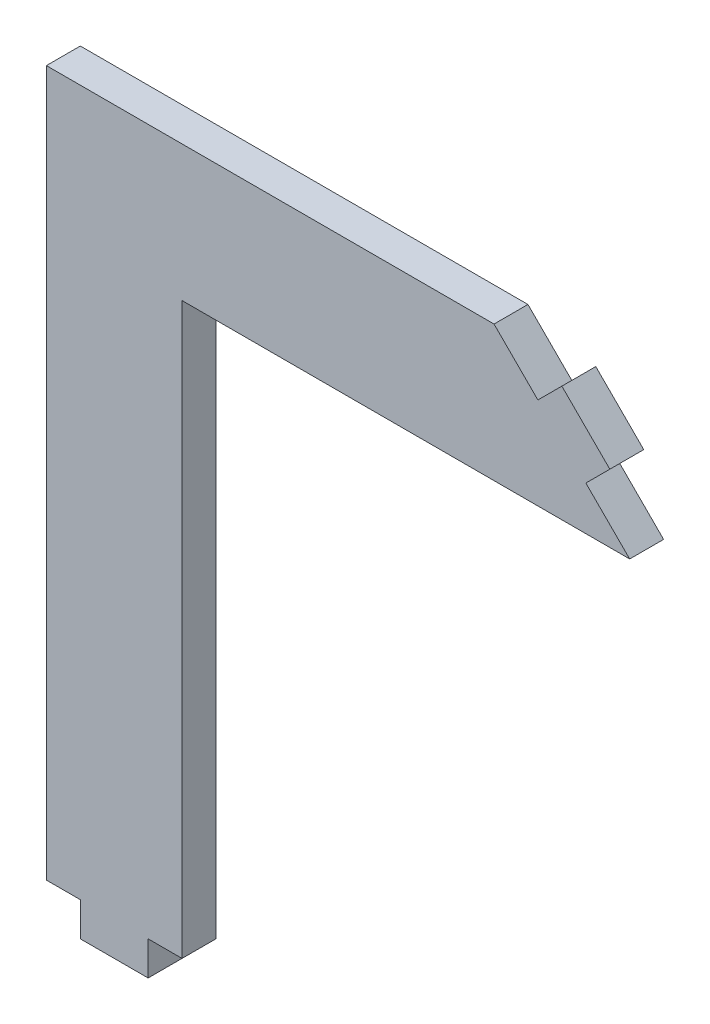
ISO-10303-21;
HEADER;
FILE_DESCRIPTION(('STEP AP214'),'2;1');
FILE_NAME('part.step','',(''),(''),'','','');
FILE_SCHEMA(('AUTOMOTIVE_DESIGN { 1 0 10303 214 1 1 1 1 }'));
ENDSEC;
DATA;
#1=APPLICATION_CONTEXT('core data for automotive mechanical design processes');
#2=APPLICATION_PROTOCOL_DEFINITION('international standard','automotive_design',2000,#1);
#3=PRODUCT_CONTEXT('',#1,'mechanical');
#4=PRODUCT('Part','Part','',(#3));
#5=PRODUCT_RELATED_PRODUCT_CATEGORY('part','',(#4));
#6=PRODUCT_DEFINITION_FORMATION('','',#4);
#7=PRODUCT_DEFINITION_CONTEXT('part definition',#1,'design');
#8=PRODUCT_DEFINITION('design','',#6,#7);
#9=PRODUCT_DEFINITION_SHAPE('','',#8);
#10=(LENGTH_UNIT() NAMED_UNIT(*) SI_UNIT(.MILLI.,.METRE.));
#11=(NAMED_UNIT(*) PLANE_ANGLE_UNIT() SI_UNIT($,.RADIAN.));
#12=(NAMED_UNIT(*) SI_UNIT($,.STERADIAN.) SOLID_ANGLE_UNIT());
#13=UNCERTAINTY_MEASURE_WITH_UNIT(LENGTH_MEASURE(1.E-05),#10,'distance_accuracy_value','');
#14=(GEOMETRIC_REPRESENTATION_CONTEXT(3) GLOBAL_UNCERTAINTY_ASSIGNED_CONTEXT((#13)) GLOBAL_UNIT_ASSIGNED_CONTEXT((#10,
#11,#12)) REPRESENTATION_CONTEXT('',''));
#15=CARTESIAN_POINT('',(0.,0.,0.));
#16=DIRECTION('',(0.,0.,1.));
#17=DIRECTION('',(1.,0.,0.));
#18=AXIS2_PLACEMENT_3D('',#15,#16,#17);
#19=CARTESIAN_POINT('',(0.,-66.04,0.));
#20=DIRECTION('',(0.,1.,0.));
#21=DIRECTION('',(0.,0.,1.));
#22=AXIS2_PLACEMENT_3D('',#19,#20,#21);
#23=PLANE('',#22);
#24=DIRECTION('',(0.,0.,-1.));
#25=VECTOR('',#24,1.);
#26=CARTESIAN_POINT('',(-38.735,-66.04,3.175));
#27=LINE('',#26,#25);
#28=CARTESIAN_POINT('',(-38.735,-66.04,3.175));
#29=VERTEX_POINT('',#28);
#30=CARTESIAN_POINT('',(-38.735,-66.04,0.));
#31=VERTEX_POINT('',#30);
#32=EDGE_CURVE('E166',#29,#31,#27,.T.);
#33=ORIENTED_EDGE('',*,*,#32,.F.);
#34=DIRECTION('',(-1.,0.,0.));
#35=VECTOR('',#34,1.);
#36=CARTESIAN_POINT('',(-29.21,-66.04,3.175));
#37=LINE('',#36,#35);
#38=CARTESIAN_POINT('',(-41.91,-66.04,3.175));
#39=VERTEX_POINT('',#38);
#40=EDGE_CURVE('E182',#29,#39,#37,.T.);
#41=ORIENTED_EDGE('',*,*,#40,.T.);
#42=DIRECTION('',(0.,0.,-1.));
#43=VECTOR('',#42,1.);
#44=CARTESIAN_POINT('',(-41.91,-66.04,3.175));
#45=LINE('',#44,#43);
#46=CARTESIAN_POINT('',(-41.91,-66.04,0.));
#47=VERTEX_POINT('',#46);
#48=EDGE_CURVE('E186',#39,#47,#45,.T.);
#49=ORIENTED_EDGE('',*,*,#48,.T.);
#50=DIRECTION('',(1.,0.,0.));
#51=VECTOR('',#50,1.);
#52=CARTESIAN_POINT('',(-29.21,-66.04,0.));
#53=LINE('',#52,#51);
#54=EDGE_CURVE('E63',#47,#31,#53,.T.);
#55=ORIENTED_EDGE('',*,*,#54,.T.);
#56=EDGE_LOOP('',(#33,#41,#49,#55));
#57=FACE_BOUND('',#56,.T.);
#58=ADVANCED_FACE('F39',(#57),#23,.F.);
#59=DIRECTION('',(0.,0.,1.));
#60=VECTOR('',#59,1.);
#61=CARTESIAN_POINT('',(-32.385,-66.04,3.175));
#62=LINE('',#61,#60);
#63=CARTESIAN_POINT('',(-32.385,-66.04,0.));
#64=VERTEX_POINT('',#63);
#65=CARTESIAN_POINT('',(-32.385,-66.04,3.175));
#66=VERTEX_POINT('',#65);
#67=EDGE_CURVE('E55',#64,#66,#62,.T.);
#68=ORIENTED_EDGE('',*,*,#67,.F.);
#69=CARTESIAN_POINT('',(-29.21,-66.04,0.));
#70=VERTEX_POINT('',#69);
#71=EDGE_CURVE('E189',#64,#70,#53,.T.);
#72=ORIENTED_EDGE('',*,*,#71,.T.);
#73=DIRECTION('',(0.,0.,1.));
#74=VECTOR('',#73,1.);
#75=CARTESIAN_POINT('',(-29.21,-66.04,3.175));
#76=LINE('',#75,#74);
#77=CARTESIAN_POINT('',(-29.21,-66.04,3.175));
#78=VERTEX_POINT('',#77);
#79=EDGE_CURVE('E173',#70,#78,#76,.T.);
#80=ORIENTED_EDGE('',*,*,#79,.T.);
#81=EDGE_CURVE('E183',#78,#66,#37,.T.);
#82=ORIENTED_EDGE('',*,*,#81,.T.);
#83=EDGE_LOOP('',(#68,#72,#80,#82));
#84=FACE_BOUND('',#83,.T.);
#85=ADVANCED_FACE('F294',(#84),#23,.F.);
#86=CARTESIAN_POINT('',(0.,-12.7,3.175));
#87=DIRECTION('',(0.,1.,0.));
#88=DIRECTION('',(0.,0.,1.));
#89=AXIS2_PLACEMENT_3D('',#86,#87,#88);
#90=PLANE('',#89);
#91=DIRECTION('',(0.,0.,1.));
#92=VECTOR('',#91,1.);
#93=CARTESIAN_POINT('',(-29.21,-12.7,3.175));
#94=LINE('',#93,#92);
#95=CARTESIAN_POINT('',(-29.21,-12.7,0.));
#96=VERTEX_POINT('',#95);
#97=CARTESIAN_POINT('',(-29.21,-12.7,3.175));
#98=VERTEX_POINT('',#97);
#99=EDGE_CURVE('E168',#96,#98,#94,.T.);
#100=ORIENTED_EDGE('',*,*,#99,.F.);
#101=DIRECTION('',(1.,0.,0.));
#102=VECTOR('',#101,1.);
#103=CARTESIAN_POINT('',(0.,-12.7,0.));
#104=LINE('',#103,#102);
#105=CARTESIAN_POINT('',(12.7,-12.7,0.));
#106=VERTEX_POINT('',#105);
#107=EDGE_CURVE('E259',#96,#106,#104,.T.);
#108=ORIENTED_EDGE('',*,*,#107,.T.);
#109=DIRECTION('',(0.,0.,-1.));
#110=VECTOR('',#109,1.);
#111=CARTESIAN_POINT('',(12.7,-12.7,3.175));
#112=LINE('',#111,#110);
#113=CARTESIAN_POINT('',(12.7,-12.6999999999999,3.175));
#114=VERTEX_POINT('',#113);
#115=EDGE_CURVE('E11',#114,#106,#112,.T.);
#116=ORIENTED_EDGE('',*,*,#115,.F.);
#117=DIRECTION('',(1.,0.,0.));
#118=VECTOR('',#117,1.);
#119=CARTESIAN_POINT('',(0.,-12.7,3.175));
#120=LINE('',#119,#118);
#121=EDGE_CURVE('E264',#98,#114,#120,.T.);
#122=ORIENTED_EDGE('',*,*,#121,.F.);
#123=EDGE_LOOP('',(#100,#108,#116,#122));
#124=FACE_BOUND('',#123,.T.);
#125=ADVANCED_FACE('F41',(#124),#90,.F.);
#126=CARTESIAN_POINT('',(0.,0.,3.175));
#127=DIRECTION('',(-0.707106781186544,-0.707106781186551,0.));
#128=DIRECTION('',(0.707106781186551,-0.707106781186544,0.));
#129=AXIS2_PLACEMENT_3D('',#126,#127,#128);
#130=PLANE('',#129);
#131=DIRECTION('',(0.,0.,-1.));
#132=VECTOR('',#131,1.);
#133=CARTESIAN_POINT('',(8.5950640302673,-8.59506403026721,3.175));
#134=LINE('',#133,#132);
#135=CARTESIAN_POINT('',(8.5950640302673,-8.59506403026721,3.175));
#136=VERTEX_POINT('',#135);
#137=CARTESIAN_POINT('',(8.59506403026731,-8.59506403026721,0.));
#138=VERTEX_POINT('',#137);
#139=EDGE_CURVE('E217',#136,#138,#134,.T.);
#140=ORIENTED_EDGE('',*,*,#139,.F.);
#141=DIRECTION('',(-0.707106781186551,0.707106781186544,0.));
#142=VECTOR('',#141,1.);
#143=CARTESIAN_POINT('',(0.,0.,3.175));
#144=LINE('',#143,#142);
#145=EDGE_CURVE('E255',#114,#136,#144,.T.);
#146=ORIENTED_EDGE('',*,*,#145,.F.);
#147=ORIENTED_EDGE('',*,*,#115,.T.);
#148=DIRECTION('',(-0.707106781186551,0.707106781186544,0.));
#149=VECTOR('',#148,1.);
#150=CARTESIAN_POINT('',(0.,0.,0.));
#151=LINE('',#150,#149);
#152=EDGE_CURVE('E261',#106,#138,#151,.T.);
#153=ORIENTED_EDGE('',*,*,#152,.T.);
#154=EDGE_LOOP('',(#140,#146,#147,#153));
#155=FACE_BOUND('',#154,.T.);
#156=ADVANCED_FACE('F349',(#155),#130,.F.);
#157=DIRECTION('',(0.,0.,1.));
#158=VECTOR('',#157,1.);
#159=CARTESIAN_POINT('',(4.1049359697327,-4.10493596973266,3.175));
#160=LINE('',#159,#158);
#161=CARTESIAN_POINT('',(4.1049359697327,-4.10493596973266,0.));
#162=VERTEX_POINT('',#161);
#163=CARTESIAN_POINT('',(4.1049359697327,-4.10493596973266,3.175));
#164=VERTEX_POINT('',#163);
#165=EDGE_CURVE('E223',#162,#164,#160,.T.);
#166=ORIENTED_EDGE('',*,*,#165,.F.);
#167=CARTESIAN_POINT('',(0.,0.,0.));
#168=VERTEX_POINT('',#167);
#169=EDGE_CURVE('E254',#162,#168,#151,.T.);
#170=ORIENTED_EDGE('',*,*,#169,.T.);
#171=DIRECTION('',(0.,0.,-1.));
#172=VECTOR('',#171,1.);
#173=CARTESIAN_POINT('',(0.,0.,3.175));
#174=LINE('',#173,#172);
#175=CARTESIAN_POINT('',(0.,0.,3.175));
#176=VERTEX_POINT('',#175);
#177=EDGE_CURVE('E48',#176,#168,#174,.T.);
#178=ORIENTED_EDGE('',*,*,#177,.F.);
#179=EDGE_CURVE('E260',#164,#176,#144,.T.);
#180=ORIENTED_EDGE('',*,*,#179,.F.);
#181=EDGE_LOOP('',(#166,#170,#178,#180));
#182=FACE_BOUND('',#181,.T.);
#183=ADVANCED_FACE('F352',(#182),#130,.F.);
#184=CARTESIAN_POINT('',(0.,0.,3.175));
#185=DIRECTION('',(0.,0.,1.));
#186=DIRECTION('',(1.,0.,0.));
#187=AXIS2_PLACEMENT_3D('',#184,#185,#186);
#188=PLANE('',#187);
#189=ORIENTED_EDGE('',*,*,#145,.T.);
#190=DIRECTION('',(-0.707106781186544,-0.707106781186551,0.));
#191=VECTOR('',#190,1.);
#192=CARTESIAN_POINT('',(10.8401280605346,-6.34999999999991,3.175));
#193=LINE('',#192,#191);
#194=CARTESIAN_POINT('',(10.8401280605346,-6.34999999999991,3.175));
#195=VERTEX_POINT('',#194);
#196=EDGE_CURVE('E250',#195,#136,#193,.T.);
#197=ORIENTED_EDGE('',*,*,#196,.F.);
#198=DIRECTION('',(0.707106781186551,-0.707106781186544,0.));
#199=VECTOR('',#198,1.);
#200=CARTESIAN_POINT('',(6.34999999999998,-1.85987193946536,3.175));
#201=LINE('',#200,#199);
#202=CARTESIAN_POINT('',(6.34999999999998,-1.85987193946536,3.175));
#203=VERTEX_POINT('',#202);
#204=EDGE_CURVE('E218',#203,#195,#201,.T.);
#205=ORIENTED_EDGE('',*,*,#204,.F.);
#206=DIRECTION('',(-0.707106781186544,-0.707106781186551,0.));
#207=VECTOR('',#206,1.);
#208=CARTESIAN_POINT('',(6.34999999999998,-1.85987193946536,3.175));
#209=LINE('',#208,#207);
#210=EDGE_CURVE('E232',#203,#164,#209,.T.);
#211=ORIENTED_EDGE('',*,*,#210,.T.);
#212=ORIENTED_EDGE('',*,*,#179,.T.);
#213=DIRECTION('',(1.,0.,0.));
#214=VECTOR('',#213,1.);
#215=CARTESIAN_POINT('',(-41.91,0.,3.175));
#216=LINE('',#215,#214);
#217=CARTESIAN_POINT('',(-41.91,0.,3.175));
#218=VERTEX_POINT('',#217);
#219=EDGE_CURVE('E213',#218,#176,#216,.T.);
#220=ORIENTED_EDGE('',*,*,#219,.F.);
#221=DIRECTION('',(0.,1.,0.));
#222=VECTOR('',#221,1.);
#223=CARTESIAN_POINT('',(-41.91,-12.7,3.175));
#224=LINE('',#223,#222);
#225=EDGE_CURVE('E203',#39,#218,#224,.T.);
#226=ORIENTED_EDGE('',*,*,#225,.F.);
#227=ORIENTED_EDGE('',*,*,#40,.F.);
#228=DIRECTION('',(0.,1.,0.));
#229=VECTOR('',#228,1.);
#230=CARTESIAN_POINT('',(-38.735,-69.215,3.175));
#231=LINE('',#230,#229);
#232=CARTESIAN_POINT('',(-38.735,-69.215,3.175));
#233=VERTEX_POINT('',#232);
#234=EDGE_CURVE('E311',#233,#29,#231,.T.);
#235=ORIENTED_EDGE('',*,*,#234,.F.);
#236=DIRECTION('',(-1.,0.,0.));
#237=VECTOR('',#236,1.);
#238=CARTESIAN_POINT('',(-32.385,-69.215,3.175));
#239=LINE('',#238,#237);
#240=CARTESIAN_POINT('',(-32.385,-69.215,3.175));
#241=VERTEX_POINT('',#240);
#242=EDGE_CURVE('E159',#241,#233,#239,.T.);
#243=ORIENTED_EDGE('',*,*,#242,.F.);
#244=DIRECTION('',(0.,1.,0.));
#245=VECTOR('',#244,1.);
#246=CARTESIAN_POINT('',(-32.385,-69.215,3.175));
#247=LINE('',#246,#245);
#248=EDGE_CURVE('E175',#241,#66,#247,.T.);
#249=ORIENTED_EDGE('',*,*,#248,.T.);
#250=ORIENTED_EDGE('',*,*,#81,.F.);
#251=DIRECTION('',(0.,1.,0.));
#252=VECTOR('',#251,1.);
#253=CARTESIAN_POINT('',(-29.21,-66.04,3.175));
#254=LINE('',#253,#252);
#255=EDGE_CURVE('E196',#78,#98,#254,.T.);
#256=ORIENTED_EDGE('',*,*,#255,.T.);
#257=ORIENTED_EDGE('',*,*,#121,.T.);
#258=EDGE_LOOP('',(#189,#197,#205,#211,#212,#220,#226,#227,#235,#243,#249,#250,#256,#257));
#259=FACE_BOUND('',#258,.T.);
#260=ADVANCED_FACE('F287',(#259),#188,.T.);
#261=CARTESIAN_POINT('',(0.,0.,0.));
#262=DIRECTION('',(0.,0.,1.));
#263=DIRECTION('',(1.,0.,0.));
#264=AXIS2_PLACEMENT_3D('',#261,#262,#263);
#265=PLANE('',#264);
#266=ORIENTED_EDGE('',*,*,#107,.F.);
#267=DIRECTION('',(0.,1.,0.));
#268=VECTOR('',#267,1.);
#269=CARTESIAN_POINT('',(-29.21,-66.04,0.));
#270=LINE('',#269,#268);
#271=EDGE_CURVE('E191',#70,#96,#270,.T.);
#272=ORIENTED_EDGE('',*,*,#271,.F.);
#273=ORIENTED_EDGE('',*,*,#71,.F.);
#274=DIRECTION('',(0.,1.,0.));
#275=VECTOR('',#274,1.);
#276=CARTESIAN_POINT('',(-32.385,-69.215,0.));
#277=LINE('',#276,#275);
#278=CARTESIAN_POINT('',(-32.385,-69.215,0.));
#279=VERTEX_POINT('',#278);
#280=EDGE_CURVE('E149',#279,#64,#277,.T.);
#281=ORIENTED_EDGE('',*,*,#280,.F.);
#282=DIRECTION('',(1.,0.,0.));
#283=VECTOR('',#282,1.);
#284=CARTESIAN_POINT('',(-32.385,-69.215,0.));
#285=LINE('',#284,#283);
#286=CARTESIAN_POINT('',(-38.735,-69.215,0.));
#287=VERTEX_POINT('',#286);
#288=EDGE_CURVE('E141',#287,#279,#285,.T.);
#289=ORIENTED_EDGE('',*,*,#288,.F.);
#290=DIRECTION('',(0.,1.,0.));
#291=VECTOR('',#290,1.);
#292=CARTESIAN_POINT('',(-38.735,-69.215,0.));
#293=LINE('',#292,#291);
#294=EDGE_CURVE('E146',#287,#31,#293,.T.);
#295=ORIENTED_EDGE('',*,*,#294,.T.);
#296=ORIENTED_EDGE('',*,*,#54,.F.);
#297=DIRECTION('',(0.,-1.,0.));
#298=VECTOR('',#297,1.);
#299=CARTESIAN_POINT('',(-41.91,-12.7,0.));
#300=LINE('',#299,#298);
#301=CARTESIAN_POINT('',(-41.91,0.,0.));
#302=VERTEX_POINT('',#301);
#303=EDGE_CURVE('E200',#302,#47,#300,.T.);
#304=ORIENTED_EDGE('',*,*,#303,.F.);
#305=DIRECTION('',(1.,0.,0.));
#306=VECTOR('',#305,1.);
#307=CARTESIAN_POINT('',(-41.91,0.,0.));
#308=LINE('',#307,#306);
#309=EDGE_CURVE('E209',#302,#168,#308,.T.);
#310=ORIENTED_EDGE('',*,*,#309,.T.);
#311=ORIENTED_EDGE('',*,*,#169,.F.);
#312=DIRECTION('',(-0.707106781186544,-0.707106781186551,0.));
#313=VECTOR('',#312,1.);
#314=CARTESIAN_POINT('',(6.34999999999998,-1.85987193946536,0.));
#315=LINE('',#314,#313);
#316=CARTESIAN_POINT('',(6.34999999999998,-1.85987193946536,0.));
#317=VERTEX_POINT('',#316);
#318=EDGE_CURVE('E242',#317,#162,#315,.T.);
#319=ORIENTED_EDGE('',*,*,#318,.F.);
#320=DIRECTION('',(-0.707106781186551,0.707106781186544,0.));
#321=VECTOR('',#320,1.);
#322=CARTESIAN_POINT('',(6.34999999999998,-1.85987193946536,0.));
#323=LINE('',#322,#321);
#324=CARTESIAN_POINT('',(10.8401280605346,-6.34999999999991,0.));
#325=VERTEX_POINT('',#324);
#326=EDGE_CURVE('E226',#325,#317,#323,.T.);
#327=ORIENTED_EDGE('',*,*,#326,.F.);
#328=DIRECTION('',(-0.707106781186544,-0.707106781186551,0.));
#329=VECTOR('',#328,1.);
#330=CARTESIAN_POINT('',(10.8401280605346,-6.34999999999991,0.));
#331=LINE('',#330,#329);
#332=EDGE_CURVE('E246',#325,#138,#331,.T.);
#333=ORIENTED_EDGE('',*,*,#332,.T.);
#334=ORIENTED_EDGE('',*,*,#152,.F.);
#335=EDGE_LOOP('',(#266,#272,#273,#281,#289,#295,#296,#304,#310,#311,#319,#327,#333,#334));
#336=FACE_BOUND('',#335,.T.);
#337=ADVANCED_FACE('F144',(#336),#265,.F.);
#338=CARTESIAN_POINT('',(10.8401280605346,-6.34999999999991,3.175));
#339=DIRECTION('',(-0.707106781186551,0.707106781186544,0.));
#340=DIRECTION('',(-0.707106781186544,-0.707106781186551,0.));
#341=AXIS2_PLACEMENT_3D('',#338,#339,#340);
#342=PLANE('',#341);
#343=ORIENTED_EDGE('',*,*,#139,.T.);
#344=ORIENTED_EDGE('',*,*,#332,.F.);
#345=DIRECTION('',(0.,0.,-1.));
#346=VECTOR('',#345,1.);
#347=CARTESIAN_POINT('',(10.8401280605346,-6.34999999999991,3.175));
#348=LINE('',#347,#346);
#349=EDGE_CURVE('E222',#195,#325,#348,.T.);
#350=ORIENTED_EDGE('',*,*,#349,.F.);
#351=ORIENTED_EDGE('',*,*,#196,.T.);
#352=EDGE_LOOP('',(#343,#344,#350,#351));
#353=FACE_BOUND('',#352,.T.);
#354=ADVANCED_FACE('F344',(#353),#342,.F.);
#355=CARTESIAN_POINT('',(6.34999999999998,-1.85987193946536,3.175));
#356=DIRECTION('',(0.707106781186551,-0.707106781186544,0.));
#357=DIRECTION('',(0.707106781186544,0.707106781186551,0.));
#358=AXIS2_PLACEMENT_3D('',#355,#356,#357);
#359=PLANE('',#358);
#360=ORIENTED_EDGE('',*,*,#165,.T.);
#361=ORIENTED_EDGE('',*,*,#210,.F.);
#362=DIRECTION('',(0.,0.,1.));
#363=VECTOR('',#362,1.);
#364=CARTESIAN_POINT('',(6.34999999999998,-1.85987193946536,3.175));
#365=LINE('',#364,#363);
#366=EDGE_CURVE('E229',#317,#203,#365,.T.);
#367=ORIENTED_EDGE('',*,*,#366,.F.);
#368=ORIENTED_EDGE('',*,*,#318,.T.);
#369=EDGE_LOOP('',(#360,#361,#367,#368));
#370=FACE_BOUND('',#369,.T.);
#371=ADVANCED_FACE('F340',(#370),#359,.F.);
#372=CARTESIAN_POINT('',(2.24506403026728,2.2450640302673,0.));
#373=DIRECTION('',(0.707106781186544,0.707106781186551,0.));
#374=DIRECTION('',(-0.707106781186551,0.707106781186544,0.));
#375=AXIS2_PLACEMENT_3D('',#372,#373,#374);
#376=PLANE('',#375);
#377=ORIENTED_EDGE('',*,*,#204,.T.);
#378=ORIENTED_EDGE('',*,*,#349,.T.);
#379=ORIENTED_EDGE('',*,*,#326,.T.);
#380=ORIENTED_EDGE('',*,*,#366,.T.);
#381=EDGE_LOOP('',(#377,#378,#379,#380));
#382=FACE_BOUND('',#381,.T.);
#383=ADVANCED_FACE('F337',(#382),#376,.T.);
#384=CARTESIAN_POINT('',(-41.91,0.,0.));
#385=DIRECTION('',(0.,-1.,0.));
#386=DIRECTION('',(1.,0.,0.));
#387=AXIS2_PLACEMENT_3D('',#384,#385,#386);
#388=PLANE('',#387);
#389=ORIENTED_EDGE('',*,*,#177,.T.);
#390=ORIENTED_EDGE('',*,*,#309,.F.);
#391=DIRECTION('',(0.,0.,-1.));
#392=VECTOR('',#391,1.);
#393=CARTESIAN_POINT('',(-41.91,0.,0.));
#394=LINE('',#393,#392);
#395=EDGE_CURVE('E206',#218,#302,#394,.T.);
#396=ORIENTED_EDGE('',*,*,#395,.F.);
#397=ORIENTED_EDGE('',*,*,#219,.T.);
#398=EDGE_LOOP('',(#389,#390,#396,#397));
#399=FACE_BOUND('',#398,.T.);
#400=ADVANCED_FACE('F273',(#399),#388,.F.);
#401=CARTESIAN_POINT('',(-41.91,0.,0.));
#402=DIRECTION('',(1.,0.,0.));
#403=DIRECTION('',(0.,1.,0.));
#404=AXIS2_PLACEMENT_3D('',#401,#402,#403);
#405=PLANE('',#404);
#406=ORIENTED_EDGE('',*,*,#303,.T.);
#407=ORIENTED_EDGE('',*,*,#48,.F.);
#408=ORIENTED_EDGE('',*,*,#225,.T.);
#409=ORIENTED_EDGE('',*,*,#395,.T.);
#410=EDGE_LOOP('',(#406,#407,#408,#409));
#411=FACE_BOUND('',#410,.T.);
#412=ADVANCED_FACE('F282',(#411),#405,.F.);
#413=CARTESIAN_POINT('',(-29.21,-66.04,3.175));
#414=DIRECTION('',(-1.,0.,0.));
#415=DIRECTION('',(0.,0.,1.));
#416=AXIS2_PLACEMENT_3D('',#413,#414,#415);
#417=PLANE('',#416);
#418=ORIENTED_EDGE('',*,*,#99,.T.);
#419=ORIENTED_EDGE('',*,*,#255,.F.);
#420=ORIENTED_EDGE('',*,*,#79,.F.);
#421=ORIENTED_EDGE('',*,*,#271,.T.);
#422=EDGE_LOOP('',(#418,#419,#420,#421));
#423=FACE_BOUND('',#422,.T.);
#424=ADVANCED_FACE('F299',(#423),#417,.F.);
#425=CARTESIAN_POINT('',(-38.735,-69.215,3.175));
#426=DIRECTION('',(1.,0.,0.));
#427=DIRECTION('',(0.,0.,-1.));
#428=AXIS2_PLACEMENT_3D('',#425,#426,#427);
#429=PLANE('',#428);
#430=ORIENTED_EDGE('',*,*,#32,.T.);
#431=ORIENTED_EDGE('',*,*,#294,.F.);
#432=DIRECTION('',(0.,0.,-1.));
#433=VECTOR('',#432,1.);
#434=CARTESIAN_POINT('',(-38.735,-69.215,3.175));
#435=LINE('',#434,#433);
#436=EDGE_CURVE('E154',#233,#287,#435,.T.);
#437=ORIENTED_EDGE('',*,*,#436,.F.);
#438=ORIENTED_EDGE('',*,*,#234,.T.);
#439=EDGE_LOOP('',(#430,#431,#437,#438));
#440=FACE_BOUND('',#439,.T.);
#441=ADVANCED_FACE('F165',(#440),#429,.F.);
#442=CARTESIAN_POINT('',(-32.385,-69.215,3.175));
#443=DIRECTION('',(-1.,0.,0.));
#444=DIRECTION('',(0.,0.,1.));
#445=AXIS2_PLACEMENT_3D('',#442,#443,#444);
#446=PLANE('',#445);
#447=ORIENTED_EDGE('',*,*,#67,.T.);
#448=ORIENTED_EDGE('',*,*,#248,.F.);
#449=DIRECTION('',(0.,0.,1.));
#450=VECTOR('',#449,1.);
#451=CARTESIAN_POINT('',(-32.385,-69.215,3.175));
#452=LINE('',#451,#450);
#453=EDGE_CURVE('E153',#279,#241,#452,.T.);
#454=ORIENTED_EDGE('',*,*,#453,.F.);
#455=ORIENTED_EDGE('',*,*,#280,.T.);
#456=EDGE_LOOP('',(#447,#448,#454,#455));
#457=FACE_BOUND('',#456,.T.);
#458=ADVANCED_FACE('F304',(#457),#446,.F.);
#459=CARTESIAN_POINT('',(0.,-69.215,0.));
#460=DIRECTION('',(0.,1.,0.));
#461=DIRECTION('',(0.,0.,1.));
#462=AXIS2_PLACEMENT_3D('',#459,#460,#461);
#463=PLANE('',#462);
#464=ORIENTED_EDGE('',*,*,#436,.T.);
#465=ORIENTED_EDGE('',*,*,#288,.T.);
#466=ORIENTED_EDGE('',*,*,#453,.T.);
#467=ORIENTED_EDGE('',*,*,#242,.T.);
#468=EDGE_LOOP('',(#464,#465,#466,#467));
#469=FACE_BOUND('',#468,.T.);
#470=ADVANCED_FACE('F157',(#469),#463,.F.);
#471=CLOSED_SHELL('',(#58,#85,#125,#156,#183,#260,#337,#354,#371,#383,#400,#412,#424,#441,#458,#470));
#472=MANIFOLD_SOLID_BREP('B2',#471);
#473=ADVANCED_BREP_SHAPE_REPRESENTATION('',(#18,#472),#14);
#474=SHAPE_DEFINITION_REPRESENTATION(#9,#473);
ENDSEC;
END-ISO-10303-21;
